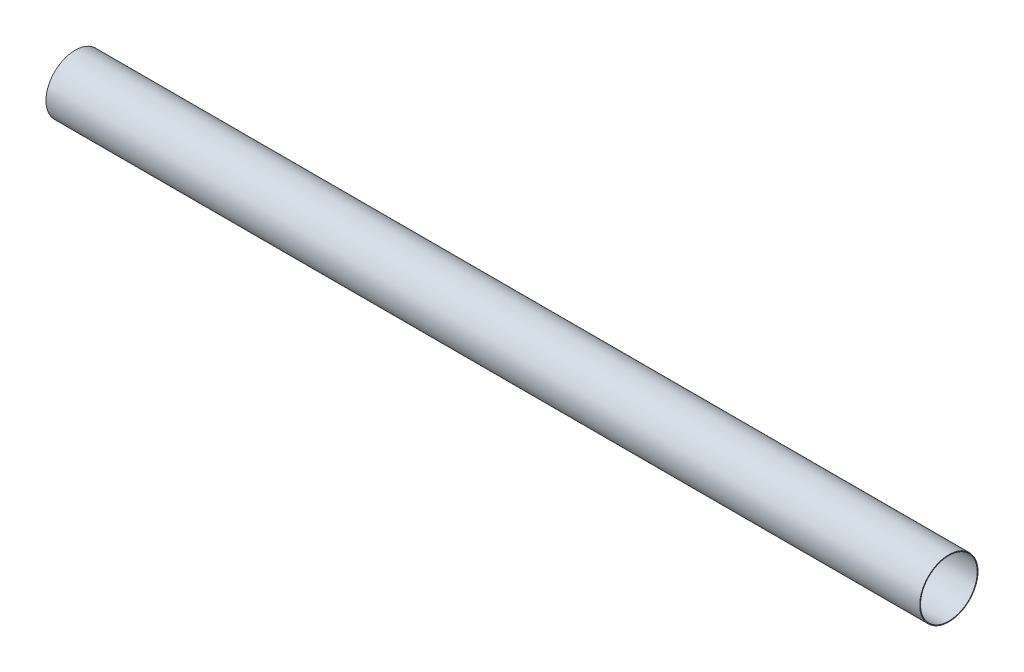
ISO-10303-21;
HEADER;
FILE_DESCRIPTION(('STEP AP214'),'2;1');
FILE_NAME('part.step','',(''),(''),'','','');
FILE_SCHEMA(('AUTOMOTIVE_DESIGN { 1 0 10303 214 1 1 1 1 }'));
ENDSEC;
DATA;
#1=APPLICATION_CONTEXT('core data for automotive mechanical design processes');
#2=APPLICATION_PROTOCOL_DEFINITION('international standard','automotive_design',2000,#1);
#3=PRODUCT_CONTEXT('',#1,'mechanical');
#4=PRODUCT('Part','Part','',(#3));
#5=PRODUCT_RELATED_PRODUCT_CATEGORY('part','',(#4));
#6=PRODUCT_DEFINITION_FORMATION('','',#4);
#7=PRODUCT_DEFINITION_CONTEXT('part definition',#1,'design');
#8=PRODUCT_DEFINITION('design','',#6,#7);
#9=PRODUCT_DEFINITION_SHAPE('','',#8);
#10=(LENGTH_UNIT() NAMED_UNIT(*) SI_UNIT(.MILLI.,.METRE.));
#11=(NAMED_UNIT(*) PLANE_ANGLE_UNIT() SI_UNIT($,.RADIAN.));
#12=(NAMED_UNIT(*) SI_UNIT($,.STERADIAN.) SOLID_ANGLE_UNIT());
#13=UNCERTAINTY_MEASURE_WITH_UNIT(LENGTH_MEASURE(1.E-05),#10,'distance_accuracy_value','');
#14=(GEOMETRIC_REPRESENTATION_CONTEXT(3) GLOBAL_UNCERTAINTY_ASSIGNED_CONTEXT((#13)) GLOBAL_UNIT_ASSIGNED_CONTEXT((#10,
#11,#12)) REPRESENTATION_CONTEXT('',''));
#15=CARTESIAN_POINT('',(0.,0.,0.));
#16=DIRECTION('',(0.,0.,1.));
#17=DIRECTION('',(1.,0.,0.));
#18=AXIS2_PLACEMENT_3D('',#15,#16,#17);
#19=CARTESIAN_POINT('',(4572.,0.,0.));
#20=DIRECTION('',(1.,0.,0.));
#21=DIRECTION('',(0.,0.,-1.));
#22=AXIS2_PLACEMENT_3D('',#19,#20,#21);
#23=PLANE('',#22);
#24=CARTESIAN_POINT('',(4572.,0.,0.));
#25=DIRECTION('',(1.,0.,0.));
#26=DIRECTION('',(0.,0.,-1.));
#27=AXIS2_PLACEMENT_3D('',#24,#25,#26);
#28=CIRCLE('',#27,152.4);
#29=CARTESIAN_POINT('',(4572.,0.,-152.4));
#30=VERTEX_POINT('',#29);
#31=EDGE_CURVE('E10',#30,#30,#28,.T.);
#32=ORIENTED_EDGE('',*,*,#31,.T.);
#33=EDGE_LOOP('',(#32));
#34=FACE_BOUND('',#33,.T.);
#35=CARTESIAN_POINT('',(4572.,0.,0.));
#36=DIRECTION('',(1.,0.,0.));
#37=DIRECTION('',(0.,0.,-1.));
#38=AXIS2_PLACEMENT_3D('',#35,#36,#37);
#39=CIRCLE('',#38,148.59);
#40=CARTESIAN_POINT('',(4572.,0.,-148.59));
#41=VERTEX_POINT('',#40);
#42=EDGE_CURVE('E52',#41,#41,#39,.T.);
#43=ORIENTED_EDGE('',*,*,#42,.F.);
#44=EDGE_LOOP('',(#43));
#45=FACE_BOUND('',#44,.T.);
#46=ADVANCED_FACE('F39',(#34,#45),#23,.T.);
#47=CARTESIAN_POINT('',(0.,0.,0.));
#48=DIRECTION('',(1.,0.,0.));
#49=DIRECTION('',(0.,0.,-1.));
#50=AXIS2_PLACEMENT_3D('',#47,#48,#49);
#51=PLANE('',#50);
#52=CARTESIAN_POINT('',(0.,0.,0.));
#53=DIRECTION('',(1.,0.,0.));
#54=DIRECTION('',(0.,0.,-1.));
#55=AXIS2_PLACEMENT_3D('',#52,#53,#54);
#56=CIRCLE('',#55,152.4);
#57=CARTESIAN_POINT('',(0.,0.,-152.4));
#58=VERTEX_POINT('',#57);
#59=EDGE_CURVE('E43',#58,#58,#56,.T.);
#60=ORIENTED_EDGE('',*,*,#59,.F.);
#61=EDGE_LOOP('',(#60));
#62=FACE_BOUND('',#61,.T.);
#63=CARTESIAN_POINT('',(0.,0.,0.));
#64=DIRECTION('',(1.,0.,0.));
#65=DIRECTION('',(0.,0.,-1.));
#66=AXIS2_PLACEMENT_3D('',#63,#64,#65);
#67=CIRCLE('',#66,148.59);
#68=CARTESIAN_POINT('',(0.,0.,-148.59));
#69=VERTEX_POINT('',#68);
#70=EDGE_CURVE('E54',#69,#69,#67,.T.);
#71=ORIENTED_EDGE('',*,*,#70,.T.);
#72=EDGE_LOOP('',(#71));
#73=FACE_BOUND('',#72,.T.);
#74=ADVANCED_FACE('F66',(#62,#73),#51,.F.);
#75=CARTESIAN_POINT('',(4572.,0.,0.));
#76=DIRECTION('',(-1.,0.,0.));
#77=DIRECTION('',(0.,0.,1.));
#78=AXIS2_PLACEMENT_3D('',#75,#76,#77);
#79=CYLINDRICAL_SURFACE('',#78,152.4);
#80=ORIENTED_EDGE('',*,*,#31,.F.);
#81=EDGE_LOOP('',(#80));
#82=FACE_BOUND('',#81,.T.);
#83=ORIENTED_EDGE('',*,*,#59,.T.);
#84=EDGE_LOOP('',(#83));
#85=FACE_BOUND('',#84,.T.);
#86=ADVANCED_FACE('F41',(#82,#85),#79,.T.);
#87=CARTESIAN_POINT('',(4572.,0.,0.));
#88=DIRECTION('',(-1.,0.,0.));
#89=DIRECTION('',(0.,0.,1.));
#90=AXIS2_PLACEMENT_3D('',#87,#88,#89);
#91=CYLINDRICAL_SURFACE('',#90,148.59);
#92=ORIENTED_EDGE('',*,*,#42,.T.);
#93=EDGE_LOOP('',(#92));
#94=FACE_BOUND('',#93,.T.);
#95=ORIENTED_EDGE('',*,*,#70,.F.);
#96=EDGE_LOOP('',(#95));
#97=FACE_BOUND('',#96,.T.);
#98=ADVANCED_FACE('F62',(#94,#97),#91,.F.);
#99=CLOSED_SHELL('',(#46,#74,#86,#98));
#100=MANIFOLD_SOLID_BREP('B2',#99);
#101=ADVANCED_BREP_SHAPE_REPRESENTATION('',(#18,#100),#14);
#102=SHAPE_DEFINITION_REPRESENTATION(#9,#101);
ENDSEC;
END-ISO-10303-21;
